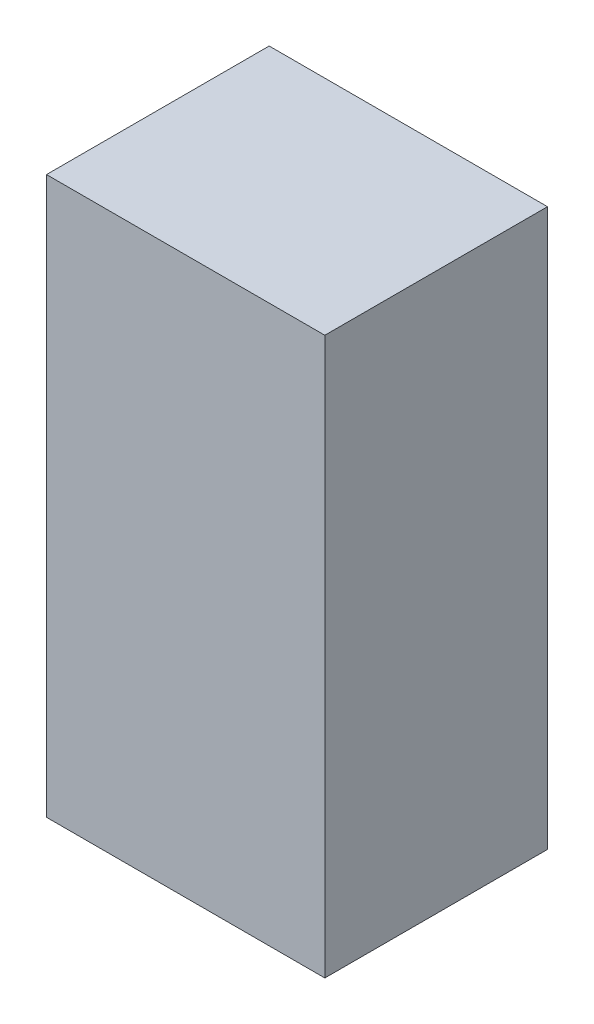
ISO-10303-21;
HEADER;
FILE_DESCRIPTION(('STEP AP214'),'2;1');
FILE_NAME('part.step','',(''),(''),'','','');
FILE_SCHEMA(('AUTOMOTIVE_DESIGN { 1 0 10303 214 1 1 1 1 }'));
ENDSEC;
DATA;
#1=APPLICATION_CONTEXT('core data for automotive mechanical design processes');
#2=APPLICATION_PROTOCOL_DEFINITION('international standard','automotive_design',2000,#1);
#3=PRODUCT_CONTEXT('',#1,'mechanical');
#4=PRODUCT('Part','Part','',(#3));
#5=PRODUCT_RELATED_PRODUCT_CATEGORY('part','',(#4));
#6=PRODUCT_DEFINITION_FORMATION('','',#4);
#7=PRODUCT_DEFINITION_CONTEXT('part definition',#1,'design');
#8=PRODUCT_DEFINITION('design','',#6,#7);
#9=PRODUCT_DEFINITION_SHAPE('','',#8);
#10=(LENGTH_UNIT() NAMED_UNIT(*) SI_UNIT(.MILLI.,.METRE.));
#11=(NAMED_UNIT(*) PLANE_ANGLE_UNIT() SI_UNIT($,.RADIAN.));
#12=(NAMED_UNIT(*) SI_UNIT($,.STERADIAN.) SOLID_ANGLE_UNIT());
#13=UNCERTAINTY_MEASURE_WITH_UNIT(LENGTH_MEASURE(1.E-05),#10,'distance_accuracy_value','');
#14=(GEOMETRIC_REPRESENTATION_CONTEXT(3) GLOBAL_UNCERTAINTY_ASSIGNED_CONTEXT((#13)) GLOBAL_UNIT_ASSIGNED_CONTEXT((#10,
#11,#12)) REPRESENTATION_CONTEXT('',''));
#15=CARTESIAN_POINT('',(0.,0.,0.));
#16=DIRECTION('',(0.,0.,1.));
#17=DIRECTION('',(1.,0.,0.));
#18=AXIS2_PLACEMENT_3D('',#15,#16,#17);
#19=CARTESIAN_POINT('',(-3.375,8.25,2.7));
#20=DIRECTION('',(1.,0.,0.));
#21=DIRECTION('',(0.,0.,-1.));
#22=AXIS2_PLACEMENT_3D('',#19,#20,#21);
#23=PLANE('',#22);
#24=DIRECTION('',(0.,0.,1.));
#25=VECTOR('',#24,1.);
#26=CARTESIAN_POINT('',(-3.375,-6.75,2.7));
#27=LINE('',#26,#25);
#28=CARTESIAN_POINT('',(-3.375,-6.75,-3.3));
#29=VERTEX_POINT('',#28);
#30=CARTESIAN_POINT('',(-3.375,-6.75,2.7));
#31=VERTEX_POINT('',#30);
#32=EDGE_CURVE('E98',#29,#31,#27,.T.);
#33=ORIENTED_EDGE('',*,*,#32,.T.);
#34=DIRECTION('',(0.,-1.,0.));
#35=VECTOR('',#34,1.);
#36=CARTESIAN_POINT('',(-3.375,8.25,2.7));
#37=LINE('',#36,#35);
#38=CARTESIAN_POINT('',(-3.375,8.25,2.7));
#39=VERTEX_POINT('',#38);
#40=EDGE_CURVE('E11',#39,#31,#37,.T.);
#41=ORIENTED_EDGE('',*,*,#40,.F.);
#42=DIRECTION('',(0.,0.,1.));
#43=VECTOR('',#42,1.);
#44=CARTESIAN_POINT('',(-3.375,8.25,2.7));
#45=LINE('',#44,#43);
#46=CARTESIAN_POINT('',(-3.375,8.25,-3.3));
#47=VERTEX_POINT('',#46);
#48=EDGE_CURVE('E86',#47,#39,#45,.T.);
#49=ORIENTED_EDGE('',*,*,#48,.F.);
#50=DIRECTION('',(0.,-1.,0.));
#51=VECTOR('',#50,1.);
#52=CARTESIAN_POINT('',(-3.375,8.25,-3.3));
#53=LINE('',#52,#51);
#54=EDGE_CURVE('E94',#47,#29,#53,.T.);
#55=ORIENTED_EDGE('',*,*,#54,.T.);
#56=EDGE_LOOP('',(#33,#41,#49,#55));
#57=FACE_BOUND('',#56,.T.);
#58=ADVANCED_FACE('F35',(#57),#23,.F.);
#59=CARTESIAN_POINT('',(-3.375,8.25,2.7));
#60=DIRECTION('',(0.,0.,-1.));
#61=DIRECTION('',(-1.,0.,0.));
#62=AXIS2_PLACEMENT_3D('',#59,#60,#61);
#63=PLANE('',#62);
#64=DIRECTION('',(1.,0.,0.));
#65=VECTOR('',#64,1.);
#66=CARTESIAN_POINT('',(-3.375,-6.75,2.7));
#67=LINE('',#66,#65);
#68=CARTESIAN_POINT('',(4.125,-6.75,2.7));
#69=VERTEX_POINT('',#68);
#70=EDGE_CURVE('E90',#31,#69,#67,.T.);
#71=ORIENTED_EDGE('',*,*,#70,.T.);
#72=DIRECTION('',(0.,-1.,0.));
#73=VECTOR('',#72,1.);
#74=CARTESIAN_POINT('',(4.125,8.25,2.7));
#75=LINE('',#74,#73);
#76=CARTESIAN_POINT('',(4.125,8.25,2.7));
#77=VERTEX_POINT('',#76);
#78=EDGE_CURVE('E43',#77,#69,#75,.T.);
#79=ORIENTED_EDGE('',*,*,#78,.F.);
#80=DIRECTION('',(1.,0.,0.));
#81=VECTOR('',#80,1.);
#82=CARTESIAN_POINT('',(-3.375,8.25,2.7));
#83=LINE('',#82,#81);
#84=EDGE_CURVE('E81',#39,#77,#83,.T.);
#85=ORIENTED_EDGE('',*,*,#84,.F.);
#86=ORIENTED_EDGE('',*,*,#40,.T.);
#87=EDGE_LOOP('',(#71,#79,#85,#86));
#88=FACE_BOUND('',#87,.T.);
#89=ADVANCED_FACE('F89',(#88),#63,.F.);
#90=CARTESIAN_POINT('',(4.125,8.25,2.7));
#91=DIRECTION('',(-1.,0.,0.));
#92=DIRECTION('',(0.,0.,1.));
#93=AXIS2_PLACEMENT_3D('',#90,#91,#92);
#94=PLANE('',#93);
#95=DIRECTION('',(0.,0.,-1.));
#96=VECTOR('',#95,1.);
#97=CARTESIAN_POINT('',(4.125,-6.75,2.7));
#98=LINE('',#97,#96);
#99=CARTESIAN_POINT('',(4.125,-6.75,-3.3));
#100=VERTEX_POINT('',#99);
#101=EDGE_CURVE('E68',#69,#100,#98,.T.);
#102=ORIENTED_EDGE('',*,*,#101,.T.);
#103=DIRECTION('',(0.,-1.,0.));
#104=VECTOR('',#103,1.);
#105=CARTESIAN_POINT('',(4.125,8.25,-3.3));
#106=LINE('',#105,#104);
#107=CARTESIAN_POINT('',(4.125,8.25,-3.3));
#108=VERTEX_POINT('',#107);
#109=EDGE_CURVE('E91',#108,#100,#106,.T.);
#110=ORIENTED_EDGE('',*,*,#109,.F.);
#111=DIRECTION('',(0.,0.,-1.));
#112=VECTOR('',#111,1.);
#113=CARTESIAN_POINT('',(4.125,8.25,2.7));
#114=LINE('',#113,#112);
#115=EDGE_CURVE('E84',#77,#108,#114,.T.);
#116=ORIENTED_EDGE('',*,*,#115,.F.);
#117=ORIENTED_EDGE('',*,*,#78,.T.);
#118=EDGE_LOOP('',(#102,#110,#116,#117));
#119=FACE_BOUND('',#118,.T.);
#120=ADVANCED_FACE('F92',(#119),#94,.F.);
#121=CARTESIAN_POINT('',(-3.375,8.25,-3.3));
#122=DIRECTION('',(0.,0.,1.));
#123=DIRECTION('',(1.,0.,0.));
#124=AXIS2_PLACEMENT_3D('',#121,#122,#123);
#125=PLANE('',#124);
#126=DIRECTION('',(-1.,0.,0.));
#127=VECTOR('',#126,1.);
#128=CARTESIAN_POINT('',(-3.375,-6.75,-3.3));
#129=LINE('',#128,#127);
#130=EDGE_CURVE('E74',#100,#29,#129,.T.);
#131=ORIENTED_EDGE('',*,*,#130,.T.);
#132=ORIENTED_EDGE('',*,*,#54,.F.);
#133=DIRECTION('',(-1.,0.,0.));
#134=VECTOR('',#133,1.);
#135=CARTESIAN_POINT('',(-3.375,8.25,-3.3));
#136=LINE('',#135,#134);
#137=EDGE_CURVE('E51',#108,#47,#136,.T.);
#138=ORIENTED_EDGE('',*,*,#137,.F.);
#139=ORIENTED_EDGE('',*,*,#109,.T.);
#140=EDGE_LOOP('',(#131,#132,#138,#139));
#141=FACE_BOUND('',#140,.T.);
#142=ADVANCED_FACE('F105',(#141),#125,.F.);
#143=CARTESIAN_POINT('',(-3.375,8.25,2.7));
#144=DIRECTION('',(0.,-1.,0.));
#145=DIRECTION('',(0.,0.,-1.));
#146=AXIS2_PLACEMENT_3D('',#143,#144,#145);
#147=PLANE('',#146);
#148=ORIENTED_EDGE('',*,*,#48,.T.);
#149=ORIENTED_EDGE('',*,*,#84,.T.);
#150=ORIENTED_EDGE('',*,*,#115,.T.);
#151=ORIENTED_EDGE('',*,*,#137,.T.);
#152=EDGE_LOOP('',(#148,#149,#150,#151));
#153=FACE_BOUND('',#152,.T.);
#154=ADVANCED_FACE('F82',(#153),#147,.F.);
#155=CARTESIAN_POINT('',(-3.375,-6.75,2.7));
#156=DIRECTION('',(0.,-1.,0.));
#157=DIRECTION('',(0.,0.,-1.));
#158=AXIS2_PLACEMENT_3D('',#155,#156,#157);
#159=PLANE('',#158);
#160=ORIENTED_EDGE('',*,*,#32,.F.);
#161=ORIENTED_EDGE('',*,*,#130,.F.);
#162=ORIENTED_EDGE('',*,*,#101,.F.);
#163=ORIENTED_EDGE('',*,*,#70,.F.);
#164=EDGE_LOOP('',(#160,#161,#162,#163));
#165=FACE_BOUND('',#164,.T.);
#166=ADVANCED_FACE('F108',(#165),#159,.T.);
#167=CLOSED_SHELL('',(#58,#89,#120,#142,#154,#166));
#168=MANIFOLD_SOLID_BREP('B2',#167);
#169=ADVANCED_BREP_SHAPE_REPRESENTATION('',(#18,#168),#14);
#170=SHAPE_DEFINITION_REPRESENTATION(#9,#169);
ENDSEC;
END-ISO-10303-21;
